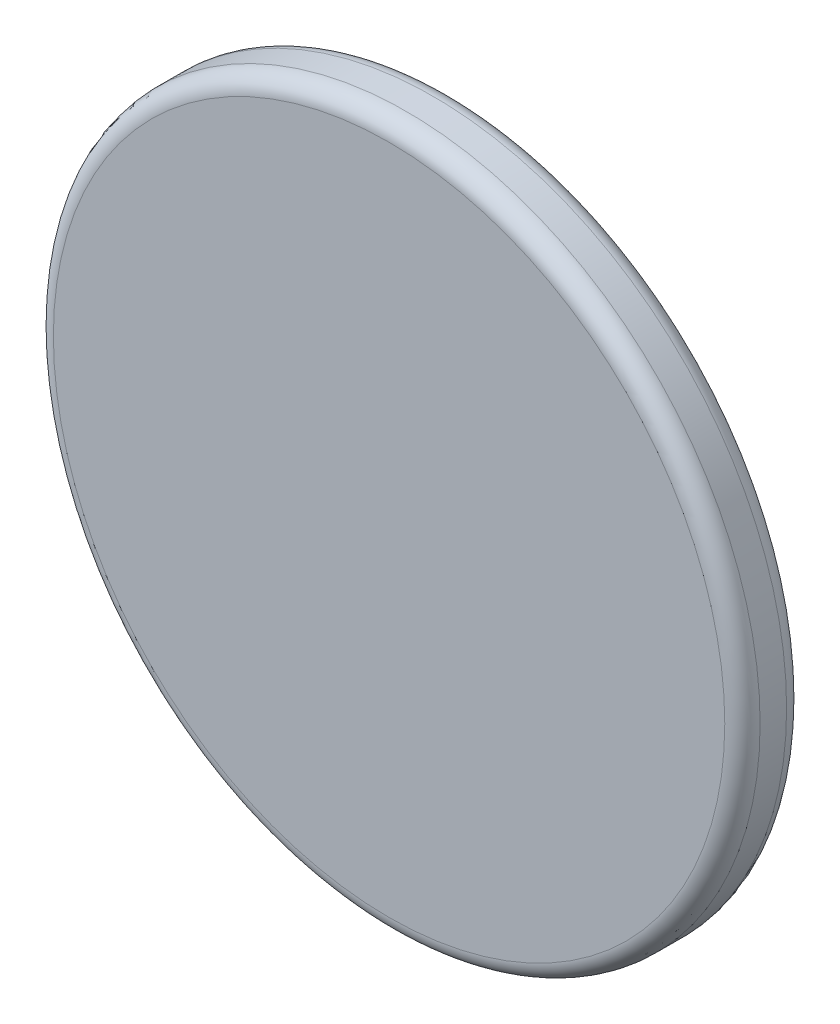
ISO-10303-21;
HEADER;
FILE_DESCRIPTION(('STEP AP214'),'2;1');
FILE_NAME('part.step','',(''),(''),'','','');
FILE_SCHEMA(('AUTOMOTIVE_DESIGN { 1 0 10303 214 1 1 1 1 }'));
ENDSEC;
DATA;
#1=APPLICATION_CONTEXT('core data for automotive mechanical design processes');
#2=APPLICATION_PROTOCOL_DEFINITION('international standard','automotive_design',2000,#1);
#3=PRODUCT_CONTEXT('',#1,'mechanical');
#4=PRODUCT('Part','Part','',(#3));
#5=PRODUCT_RELATED_PRODUCT_CATEGORY('part','',(#4));
#6=PRODUCT_DEFINITION_FORMATION('','',#4);
#7=PRODUCT_DEFINITION_CONTEXT('part definition',#1,'design');
#8=PRODUCT_DEFINITION('design','',#6,#7);
#9=PRODUCT_DEFINITION_SHAPE('','',#8);
#10=(LENGTH_UNIT() NAMED_UNIT(*) SI_UNIT(.MILLI.,.METRE.));
#11=(NAMED_UNIT(*) PLANE_ANGLE_UNIT() SI_UNIT($,.RADIAN.));
#12=(NAMED_UNIT(*) SI_UNIT($,.STERADIAN.) SOLID_ANGLE_UNIT());
#13=UNCERTAINTY_MEASURE_WITH_UNIT(LENGTH_MEASURE(1.E-05),#10,'distance_accuracy_value','');
#14=(GEOMETRIC_REPRESENTATION_CONTEXT(3) GLOBAL_UNCERTAINTY_ASSIGNED_CONTEXT((#13)) GLOBAL_UNIT_ASSIGNED_CONTEXT((#10,
#11,#12)) REPRESENTATION_CONTEXT('',''));
#15=CARTESIAN_POINT('',(0.,0.,0.));
#16=DIRECTION('',(0.,0.,1.));
#17=DIRECTION('',(1.,0.,0.));
#18=AXIS2_PLACEMENT_3D('',#15,#16,#17);
#19=CARTESIAN_POINT('',(0.,0.,7.));
#20=DIRECTION('',(0.,0.,-1.));
#21=DIRECTION('',(-1.,0.,0.));
#22=AXIS2_PLACEMENT_3D('',#19,#20,#21);
#23=CYLINDRICAL_SURFACE('',#22,40.);
#24=CARTESIAN_POINT('',(0.,0.,5.));
#25=DIRECTION('',(0.,0.,1.));
#26=DIRECTION('',(1.,0.,0.));
#27=AXIS2_PLACEMENT_3D('',#24,#25,#26);
#28=CIRCLE('',#27,40.);
#29=CARTESIAN_POINT('',(40.,0.,5.));
#30=VERTEX_POINT('',#29);
#31=EDGE_CURVE('E10',#30,#30,#28,.F.);
#32=ORIENTED_EDGE('',*,*,#31,.T.);
#33=EDGE_LOOP('',(#32));
#34=FACE_BOUND('',#33,.T.);
#35=CARTESIAN_POINT('',(0.,0.,2.));
#36=DIRECTION('',(0.,0.,1.));
#37=DIRECTION('',(1.,0.,0.));
#38=AXIS2_PLACEMENT_3D('',#35,#36,#37);
#39=CIRCLE('',#38,40.);
#40=CARTESIAN_POINT('',(40.,0.,2.));
#41=VERTEX_POINT('',#40);
#42=EDGE_CURVE('E46',#41,#41,#39,.T.);
#43=ORIENTED_EDGE('',*,*,#42,.T.);
#44=EDGE_LOOP('',(#43));
#45=FACE_BOUND('',#44,.T.);
#46=ADVANCED_FACE('F31',(#34,#45),#23,.T.);
#47=CARTESIAN_POINT('',(0.,0.,7.));
#48=DIRECTION('',(0.,0.,1.));
#49=DIRECTION('',(1.,0.,0.));
#50=AXIS2_PLACEMENT_3D('',#47,#48,#49);
#51=PLANE('',#50);
#52=CARTESIAN_POINT('',(0.,0.,7.));
#53=DIRECTION('',(0.,0.,1.));
#54=DIRECTION('',(1.,0.,0.));
#55=AXIS2_PLACEMENT_3D('',#52,#53,#54);
#56=CIRCLE('',#55,38.);
#57=CARTESIAN_POINT('',(38.,0.,7.));
#58=VERTEX_POINT('',#57);
#59=EDGE_CURVE('E38',#58,#58,#56,.T.);
#60=ORIENTED_EDGE('',*,*,#59,.T.);
#61=EDGE_LOOP('',(#60));
#62=FACE_BOUND('',#61,.T.);
#63=ADVANCED_FACE('F62',(#62),#51,.T.);
#64=CARTESIAN_POINT('',(0.,0.,0.));
#65=DIRECTION('',(0.,0.,1.));
#66=DIRECTION('',(1.,0.,0.));
#67=AXIS2_PLACEMENT_3D('',#64,#65,#66);
#68=PLANE('',#67);
#69=CARTESIAN_POINT('',(0.,0.,0.));
#70=DIRECTION('',(0.,0.,1.));
#71=DIRECTION('',(1.,0.,0.));
#72=AXIS2_PLACEMENT_3D('',#69,#70,#71);
#73=CIRCLE('',#72,38.);
#74=CARTESIAN_POINT('',(38.,0.,0.));
#75=VERTEX_POINT('',#74);
#76=EDGE_CURVE('E42',#75,#75,#73,.F.);
#77=ORIENTED_EDGE('',*,*,#76,.T.);
#78=EDGE_LOOP('',(#77));
#79=FACE_BOUND('',#78,.T.);
#80=ADVANCED_FACE('F55',(#79),#68,.F.);
#81=CARTESIAN_POINT('',(0.,0.,2.));
#82=DIRECTION('',(0.,0.,1.));
#83=DIRECTION('',(1.,0.,0.));
#84=AXIS2_PLACEMENT_3D('',#81,#82,#83);
#85=TOROIDAL_SURFACE('',#84,38.,2.);
#86=ORIENTED_EDGE('',*,*,#76,.F.);
#87=EDGE_LOOP('',(#86));
#88=FACE_BOUND('',#87,.T.);
#89=ORIENTED_EDGE('',*,*,#42,.F.);
#90=EDGE_LOOP('',(#89));
#91=FACE_BOUND('',#90,.T.);
#92=ADVANCED_FACE('F53',(#88,#91),#85,.T.);
#93=CARTESIAN_POINT('',(0.,0.,5.));
#94=DIRECTION('',(0.,0.,1.));
#95=DIRECTION('',(1.,0.,0.));
#96=AXIS2_PLACEMENT_3D('',#93,#94,#95);
#97=TOROIDAL_SURFACE('',#96,38.,2.);
#98=ORIENTED_EDGE('',*,*,#31,.F.);
#99=EDGE_LOOP('',(#98));
#100=FACE_BOUND('',#99,.T.);
#101=ORIENTED_EDGE('',*,*,#59,.F.);
#102=EDGE_LOOP('',(#101));
#103=FACE_BOUND('',#102,.T.);
#104=ADVANCED_FACE('F33',(#100,#103),#97,.T.);
#105=CLOSED_SHELL('',(#46,#63,#80,#92,#104));
#106=MANIFOLD_SOLID_BREP('B2',#105);
#107=ADVANCED_BREP_SHAPE_REPRESENTATION('',(#18,#106),#14);
#108=SHAPE_DEFINITION_REPRESENTATION(#9,#107);
ENDSEC;
END-ISO-10303-21;
